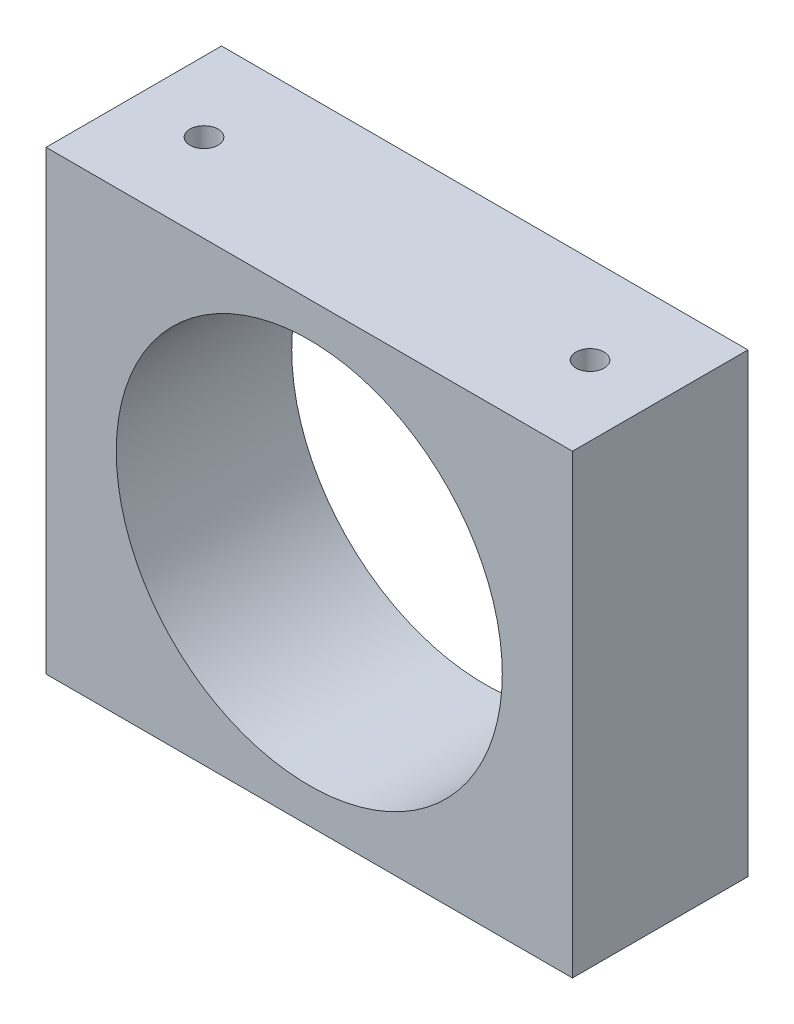
ISO-10303-21;
HEADER;
FILE_DESCRIPTION(('STEP AP214'),'2;1');
FILE_NAME('part.step','',(''),(''),'','','');
FILE_SCHEMA(('AUTOMOTIVE_DESIGN { 1 0 10303 214 1 1 1 1 }'));
ENDSEC;
DATA;
#1=APPLICATION_CONTEXT('core data for automotive mechanical design processes');
#2=APPLICATION_PROTOCOL_DEFINITION('international standard','automotive_design',2000,#1);
#3=PRODUCT_CONTEXT('',#1,'mechanical');
#4=PRODUCT('Part','Part','',(#3));
#5=PRODUCT_RELATED_PRODUCT_CATEGORY('part','',(#4));
#6=PRODUCT_DEFINITION_FORMATION('','',#4);
#7=PRODUCT_DEFINITION_CONTEXT('part definition',#1,'design');
#8=PRODUCT_DEFINITION('design','',#6,#7);
#9=PRODUCT_DEFINITION_SHAPE('','',#8);
#10=(LENGTH_UNIT() NAMED_UNIT(*) SI_UNIT(.MILLI.,.METRE.));
#11=(NAMED_UNIT(*) PLANE_ANGLE_UNIT() SI_UNIT($,.RADIAN.));
#12=(NAMED_UNIT(*) SI_UNIT($,.STERADIAN.) SOLID_ANGLE_UNIT());
#13=UNCERTAINTY_MEASURE_WITH_UNIT(LENGTH_MEASURE(1.E-05),#10,'distance_accuracy_value','');
#14=(GEOMETRIC_REPRESENTATION_CONTEXT(3) GLOBAL_UNCERTAINTY_ASSIGNED_CONTEXT((#13)) GLOBAL_UNIT_ASSIGNED_CONTEXT((#10,
#11,#12)) REPRESENTATION_CONTEXT('',''));
#15=CARTESIAN_POINT('',(0.,0.,0.));
#16=DIRECTION('',(0.,0.,1.));
#17=DIRECTION('',(1.,0.,0.));
#18=AXIS2_PLACEMENT_3D('',#15,#16,#17);
#19=CARTESIAN_POINT('',(0.,0.,10.));
#20=DIRECTION('',(0.,0.,-1.));
#21=DIRECTION('',(-1.,0.,0.));
#22=AXIS2_PLACEMENT_3D('',#19,#20,#21);
#23=PLANE('',#22);
#24=DIRECTION('',(0.,-1.,0.));
#25=VECTOR('',#24,1.);
#26=CARTESIAN_POINT('',(0.,0.,10.));
#27=LINE('',#26,#25);
#28=CARTESIAN_POINT('',(0.,26.,10.));
#29=VERTEX_POINT('',#28);
#30=CARTESIAN_POINT('',(0.,0.,10.));
#31=VERTEX_POINT('',#30);
#32=EDGE_CURVE('E134',#29,#31,#27,.T.);
#33=ORIENTED_EDGE('',*,*,#32,.T.);
#34=DIRECTION('',(1.,0.,0.));
#35=VECTOR('',#34,1.);
#36=CARTESIAN_POINT('',(0.,0.,10.));
#37=LINE('',#36,#35);
#38=CARTESIAN_POINT('',(30.,0.,10.));
#39=VERTEX_POINT('',#38);
#40=EDGE_CURVE('E81',#31,#39,#37,.T.);
#41=ORIENTED_EDGE('',*,*,#40,.T.);
#42=DIRECTION('',(0.,1.,0.));
#43=VECTOR('',#42,1.);
#44=CARTESIAN_POINT('',(30.,0.,10.));
#45=LINE('',#44,#43);
#46=CARTESIAN_POINT('',(30.,26.,10.));
#47=VERTEX_POINT('',#46);
#48=EDGE_CURVE('E137',#39,#47,#45,.T.);
#49=ORIENTED_EDGE('',*,*,#48,.T.);
#50=DIRECTION('',(-1.,0.,0.));
#51=VECTOR('',#50,1.);
#52=CARTESIAN_POINT('',(0.,26.,10.));
#53=LINE('',#52,#51);
#54=EDGE_CURVE('E50',#47,#29,#53,.T.);
#55=ORIENTED_EDGE('',*,*,#54,.T.);
#56=EDGE_LOOP('',(#33,#41,#49,#55));
#57=FACE_BOUND('',#56,.T.);
#58=CARTESIAN_POINT('',(15.,13.,10.));
#59=DIRECTION('',(0.,0.,1.));
#60=DIRECTION('',(1.,0.,0.));
#61=AXIS2_PLACEMENT_3D('',#58,#59,#60);
#62=CIRCLE('',#61,11.);
#63=CARTESIAN_POINT('',(26.,13.,10.));
#64=VERTEX_POINT('',#63);
#65=EDGE_CURVE('E128',#64,#64,#62,.T.);
#66=ORIENTED_EDGE('',*,*,#65,.F.);
#67=EDGE_LOOP('',(#66));
#68=FACE_BOUND('',#67,.T.);
#69=ADVANCED_FACE('F33',(#57,#68),#23,.F.);
#70=CARTESIAN_POINT('',(0.,0.,0.));
#71=DIRECTION('',(0.,0.,-1.));
#72=DIRECTION('',(-1.,0.,0.));
#73=AXIS2_PLACEMENT_3D('',#70,#71,#72);
#74=PLANE('',#73);
#75=DIRECTION('',(0.,-1.,0.));
#76=VECTOR('',#75,1.);
#77=CARTESIAN_POINT('',(0.,0.,0.));
#78=LINE('',#77,#76);
#79=CARTESIAN_POINT('',(0.,26.,0.));
#80=VERTEX_POINT('',#79);
#81=CARTESIAN_POINT('',(0.,0.,0.));
#82=VERTEX_POINT('',#81);
#83=EDGE_CURVE('E131',#80,#82,#78,.T.);
#84=ORIENTED_EDGE('',*,*,#83,.F.);
#85=DIRECTION('',(-1.,0.,0.));
#86=VECTOR('',#85,1.);
#87=CARTESIAN_POINT('',(0.,26.,0.));
#88=LINE('',#87,#86);
#89=CARTESIAN_POINT('',(30.,26.,0.));
#90=VERTEX_POINT('',#89);
#91=EDGE_CURVE('E74',#90,#80,#88,.T.);
#92=ORIENTED_EDGE('',*,*,#91,.F.);
#93=DIRECTION('',(0.,1.,0.));
#94=VECTOR('',#93,1.);
#95=CARTESIAN_POINT('',(30.,0.,0.));
#96=LINE('',#95,#94);
#97=CARTESIAN_POINT('',(30.,0.,0.));
#98=VERTEX_POINT('',#97);
#99=EDGE_CURVE('E68',#98,#90,#96,.T.);
#100=ORIENTED_EDGE('',*,*,#99,.F.);
#101=DIRECTION('',(1.,0.,0.));
#102=VECTOR('',#101,1.);
#103=CARTESIAN_POINT('',(0.,0.,0.));
#104=LINE('',#103,#102);
#105=EDGE_CURVE('E143',#82,#98,#104,.T.);
#106=ORIENTED_EDGE('',*,*,#105,.F.);
#107=EDGE_LOOP('',(#84,#92,#100,#106));
#108=FACE_BOUND('',#107,.T.);
#109=CARTESIAN_POINT('',(15.,13.,0.));
#110=DIRECTION('',(0.,0.,1.));
#111=DIRECTION('',(1.,0.,0.));
#112=AXIS2_PLACEMENT_3D('',#109,#110,#111);
#113=CIRCLE('',#112,11.);
#114=CARTESIAN_POINT('',(26.,13.,0.));
#115=VERTEX_POINT('',#114);
#116=EDGE_CURVE('E127',#115,#115,#113,.T.);
#117=ORIENTED_EDGE('',*,*,#116,.T.);
#118=EDGE_LOOP('',(#117));
#119=FACE_BOUND('',#118,.T.);
#120=ADVANCED_FACE('F153',(#108,#119),#74,.T.);
#121=CARTESIAN_POINT('',(0.,0.,10.));
#122=DIRECTION('',(1.,0.,0.));
#123=DIRECTION('',(0.,0.,-1.));
#124=AXIS2_PLACEMENT_3D('',#121,#122,#123);
#125=PLANE('',#124);
#126=ORIENTED_EDGE('',*,*,#83,.T.);
#127=DIRECTION('',(0.,0.,-1.));
#128=VECTOR('',#127,1.);
#129=CARTESIAN_POINT('',(0.,0.,10.));
#130=LINE('',#129,#128);
#131=EDGE_CURVE('E11',#31,#82,#130,.T.);
#132=ORIENTED_EDGE('',*,*,#131,.F.);
#133=ORIENTED_EDGE('',*,*,#32,.F.);
#134=DIRECTION('',(0.,0.,-1.));
#135=VECTOR('',#134,1.);
#136=CARTESIAN_POINT('',(0.,26.,10.));
#137=LINE('',#136,#135);
#138=EDGE_CURVE('E140',#29,#80,#137,.T.);
#139=ORIENTED_EDGE('',*,*,#138,.T.);
#140=EDGE_LOOP('',(#126,#132,#133,#139));
#141=FACE_BOUND('',#140,.T.);
#142=ADVANCED_FACE('F35',(#141),#125,.F.);
#143=CARTESIAN_POINT('',(0.,0.,10.));
#144=DIRECTION('',(0.,1.,0.));
#145=DIRECTION('',(0.,0.,1.));
#146=AXIS2_PLACEMENT_3D('',#143,#144,#145);
#147=PLANE('',#146);
#148=CARTESIAN_POINT('',(4.,0.,5.));
#149=DIRECTION('',(0.,-1.,0.));
#150=DIRECTION('',(0.,0.,-1.));
#151=AXIS2_PLACEMENT_3D('',#148,#149,#150);
#152=CIRCLE('',#151,0.79999999999999);
#153=CARTESIAN_POINT('',(4.,0.,4.20000000000001));
#154=VERTEX_POINT('',#153);
#155=EDGE_CURVE('E105',#154,#154,#152,.T.);
#156=ORIENTED_EDGE('',*,*,#155,.F.);
#157=EDGE_LOOP('',(#156));
#158=FACE_BOUND('',#157,.T.);
#159=CARTESIAN_POINT('',(26.,0.,5.));
#160=DIRECTION('',(0.,-1.,0.));
#161=DIRECTION('',(0.,0.,-1.));
#162=AXIS2_PLACEMENT_3D('',#159,#160,#161);
#163=CIRCLE('',#162,0.799999999999992);
#164=CARTESIAN_POINT('',(26.,0.,4.20000000000001));
#165=VERTEX_POINT('',#164);
#166=EDGE_CURVE('E104',#165,#165,#163,.T.);
#167=ORIENTED_EDGE('',*,*,#166,.F.);
#168=EDGE_LOOP('',(#167));
#169=FACE_BOUND('',#168,.T.);
#170=ORIENTED_EDGE('',*,*,#105,.T.);
#171=DIRECTION('',(0.,0.,-1.));
#172=VECTOR('',#171,1.);
#173=CARTESIAN_POINT('',(30.,0.,10.));
#174=LINE('',#173,#172);
#175=EDGE_CURVE('E42',#39,#98,#174,.T.);
#176=ORIENTED_EDGE('',*,*,#175,.F.);
#177=ORIENTED_EDGE('',*,*,#40,.F.);
#178=ORIENTED_EDGE('',*,*,#131,.T.);
#179=EDGE_LOOP('',(#170,#176,#177,#178));
#180=FACE_BOUND('',#179,.T.);
#181=ADVANCED_FACE('F170',(#158,#169,#180),#147,.F.);
#182=CARTESIAN_POINT('',(30.,0.,10.));
#183=DIRECTION('',(-1.,0.,0.));
#184=DIRECTION('',(0.,0.,1.));
#185=AXIS2_PLACEMENT_3D('',#182,#183,#184);
#186=PLANE('',#185);
#187=ORIENTED_EDGE('',*,*,#99,.T.);
#188=DIRECTION('',(0.,0.,-1.));
#189=VECTOR('',#188,1.);
#190=CARTESIAN_POINT('',(30.,26.,10.));
#191=LINE('',#190,#189);
#192=EDGE_CURVE('E148',#47,#90,#191,.T.);
#193=ORIENTED_EDGE('',*,*,#192,.F.);
#194=ORIENTED_EDGE('',*,*,#48,.F.);
#195=ORIENTED_EDGE('',*,*,#175,.T.);
#196=EDGE_LOOP('',(#187,#193,#194,#195));
#197=FACE_BOUND('',#196,.T.);
#198=ADVANCED_FACE('F150',(#197),#186,.F.);
#199=CARTESIAN_POINT('',(0.,26.,10.));
#200=DIRECTION('',(0.,-1.,0.));
#201=DIRECTION('',(0.,0.,-1.));
#202=AXIS2_PLACEMENT_3D('',#199,#200,#201);
#203=PLANE('',#202);
#204=CARTESIAN_POINT('',(4.,26.,5.));
#205=DIRECTION('',(0.,1.,0.));
#206=DIRECTION('',(0.,0.,1.));
#207=AXIS2_PLACEMENT_3D('',#204,#205,#206);
#208=CIRCLE('',#207,0.79999999999999);
#209=CARTESIAN_POINT('',(4.,26.,5.79999999999999));
#210=VERTEX_POINT('',#209);
#211=EDGE_CURVE('E115',#210,#210,#208,.T.);
#212=ORIENTED_EDGE('',*,*,#211,.F.);
#213=EDGE_LOOP('',(#212));
#214=FACE_BOUND('',#213,.T.);
#215=CARTESIAN_POINT('',(26.,26.,5.));
#216=DIRECTION('',(0.,1.,0.));
#217=DIRECTION('',(0.,0.,1.));
#218=AXIS2_PLACEMENT_3D('',#215,#216,#217);
#219=CIRCLE('',#218,0.799999999999992);
#220=CARTESIAN_POINT('',(26.,26.,5.79999999999999));
#221=VERTEX_POINT('',#220);
#222=EDGE_CURVE('E121',#221,#221,#219,.T.);
#223=ORIENTED_EDGE('',*,*,#222,.F.);
#224=EDGE_LOOP('',(#223));
#225=FACE_BOUND('',#224,.T.);
#226=ORIENTED_EDGE('',*,*,#91,.T.);
#227=ORIENTED_EDGE('',*,*,#138,.F.);
#228=ORIENTED_EDGE('',*,*,#54,.F.);
#229=ORIENTED_EDGE('',*,*,#192,.T.);
#230=EDGE_LOOP('',(#226,#227,#228,#229));
#231=FACE_BOUND('',#230,.T.);
#232=ADVANCED_FACE('F158',(#214,#225,#231),#203,.F.);
#233=CARTESIAN_POINT('',(15.,13.,10.));
#234=DIRECTION('',(0.,0.,-1.));
#235=DIRECTION('',(-1.,0.,0.));
#236=AXIS2_PLACEMENT_3D('',#233,#234,#235);
#237=CYLINDRICAL_SURFACE('',#236,11.);
#238=ORIENTED_EDGE('',*,*,#65,.T.);
#239=EDGE_LOOP('',(#238));
#240=FACE_BOUND('',#239,.T.);
#241=ORIENTED_EDGE('',*,*,#116,.F.);
#242=EDGE_LOOP('',(#241));
#243=FACE_BOUND('',#242,.T.);
#244=ADVANCED_FACE('F160',(#240,#243),#237,.F.);
#245=CARTESIAN_POINT('',(26.,21.,5.));
#246=DIRECTION('',(0.,1.,0.));
#247=DIRECTION('',(0.,0.,1.));
#248=AXIS2_PLACEMENT_3D('',#245,#246,#247);
#249=CONICAL_SURFACE('',#248,0.799999999999988,1.02974425867665);
#250=CARTESIAN_POINT('',(26.,20.519311504778,5.));
#251=VERTEX_POINT('',#250);
#252=VERTEX_LOOP('',#251);
#253=FACE_BOUND('',#252,.T.);
#254=CARTESIAN_POINT('',(26.,21.,5.));
#255=DIRECTION('',(0.,1.,0.));
#256=DIRECTION('',(0.,0.,1.));
#257=AXIS2_PLACEMENT_3D('',#254,#255,#256);
#258=CIRCLE('',#257,0.799999999999988);
#259=CARTESIAN_POINT('',(26.,21.,5.79999999999999));
#260=VERTEX_POINT('',#259);
#261=EDGE_CURVE('E124',#260,#260,#258,.T.);
#262=ORIENTED_EDGE('',*,*,#261,.T.);
#263=EDGE_LOOP('',(#262));
#264=FACE_BOUND('',#263,.T.);
#265=ADVANCED_FACE('F167',(#253,#264),#249,.F.);
#266=CARTESIAN_POINT('',(26.,26.,5.));
#267=DIRECTION('',(0.,1.,0.));
#268=DIRECTION('',(0.,0.,1.));
#269=AXIS2_PLACEMENT_3D('',#266,#267,#268);
#270=CYLINDRICAL_SURFACE('',#269,0.79999999999999);
#271=ORIENTED_EDGE('',*,*,#261,.F.);
#272=EDGE_LOOP('',(#271));
#273=FACE_BOUND('',#272,.T.);
#274=ORIENTED_EDGE('',*,*,#222,.T.);
#275=EDGE_LOOP('',(#274));
#276=FACE_BOUND('',#275,.T.);
#277=ADVANCED_FACE('F184',(#273,#276),#270,.F.);
#278=CARTESIAN_POINT('',(4.,21.,5.));
#279=DIRECTION('',(0.,1.,0.));
#280=DIRECTION('',(0.,0.,1.));
#281=AXIS2_PLACEMENT_3D('',#278,#279,#280);
#282=CONICAL_SURFACE('',#281,0.799999999999988,1.02974425867665);
#283=CARTESIAN_POINT('',(4.,20.519311504778,5.));
#284=VERTEX_POINT('',#283);
#285=VERTEX_LOOP('',#284);
#286=FACE_BOUND('',#285,.T.);
#287=CARTESIAN_POINT('',(4.,21.,5.));
#288=DIRECTION('',(0.,1.,0.));
#289=DIRECTION('',(0.,0.,1.));
#290=AXIS2_PLACEMENT_3D('',#287,#288,#289);
#291=CIRCLE('',#290,0.799999999999988);
#292=CARTESIAN_POINT('',(4.,21.,5.79999999999999));
#293=VERTEX_POINT('',#292);
#294=EDGE_CURVE('E118',#293,#293,#291,.T.);
#295=ORIENTED_EDGE('',*,*,#294,.T.);
#296=EDGE_LOOP('',(#295));
#297=FACE_BOUND('',#296,.T.);
#298=ADVANCED_FACE('F188',(#286,#297),#282,.F.);
#299=CARTESIAN_POINT('',(4.,26.,5.));
#300=DIRECTION('',(0.,1.,0.));
#301=DIRECTION('',(0.,0.,1.));
#302=AXIS2_PLACEMENT_3D('',#299,#300,#301);
#303=CYLINDRICAL_SURFACE('',#302,0.799999999999989);
#304=ORIENTED_EDGE('',*,*,#294,.F.);
#305=EDGE_LOOP('',(#304));
#306=FACE_BOUND('',#305,.T.);
#307=ORIENTED_EDGE('',*,*,#211,.T.);
#308=EDGE_LOOP('',(#307));
#309=FACE_BOUND('',#308,.T.);
#310=ADVANCED_FACE('F192',(#306,#309),#303,.F.);
#311=CARTESIAN_POINT('',(26.,5.,5.));
#312=DIRECTION('',(0.,-1.,0.));
#313=DIRECTION('',(0.,0.,-1.));
#314=AXIS2_PLACEMENT_3D('',#311,#312,#313);
#315=CONICAL_SURFACE('',#314,0.799999999999988,1.02974425867665);
#316=CARTESIAN_POINT('',(26.,5.48068849522205,5.));
#317=VERTEX_POINT('',#316);
#318=VERTEX_LOOP('',#317);
#319=FACE_BOUND('',#318,.T.);
#320=CARTESIAN_POINT('',(26.,5.,5.));
#321=DIRECTION('',(0.,-1.,0.));
#322=DIRECTION('',(0.,0.,-1.));
#323=AXIS2_PLACEMENT_3D('',#320,#321,#322);
#324=CIRCLE('',#323,0.799999999999988);
#325=CARTESIAN_POINT('',(26.,5.,4.20000000000001));
#326=VERTEX_POINT('',#325);
#327=EDGE_CURVE('E108',#326,#326,#324,.T.);
#328=ORIENTED_EDGE('',*,*,#327,.T.);
#329=EDGE_LOOP('',(#328));
#330=FACE_BOUND('',#329,.T.);
#331=ADVANCED_FACE('F196',(#319,#330),#315,.F.);
#332=CARTESIAN_POINT('',(26.,0.,5.));
#333=DIRECTION('',(0.,-1.,0.));
#334=DIRECTION('',(0.,0.,-1.));
#335=AXIS2_PLACEMENT_3D('',#332,#333,#334);
#336=CYLINDRICAL_SURFACE('',#335,0.79999999999999);
#337=ORIENTED_EDGE('',*,*,#327,.F.);
#338=EDGE_LOOP('',(#337));
#339=FACE_BOUND('',#338,.T.);
#340=ORIENTED_EDGE('',*,*,#166,.T.);
#341=EDGE_LOOP('',(#340));
#342=FACE_BOUND('',#341,.T.);
#343=ADVANCED_FACE('F98',(#339,#342),#336,.F.);
#344=CARTESIAN_POINT('',(4.,5.,5.));
#345=DIRECTION('',(0.,-1.,0.));
#346=DIRECTION('',(0.,0.,-1.));
#347=AXIS2_PLACEMENT_3D('',#344,#345,#346);
#348=CONICAL_SURFACE('',#347,0.799999999999988,1.02974425867665);
#349=CARTESIAN_POINT('',(4.,5.48068849522205,5.));
#350=VERTEX_POINT('',#349);
#351=VERTEX_LOOP('',#350);
#352=FACE_BOUND('',#351,.T.);
#353=CARTESIAN_POINT('',(4.,5.,5.));
#354=DIRECTION('',(0.,-1.,0.));
#355=DIRECTION('',(0.,0.,-1.));
#356=AXIS2_PLACEMENT_3D('',#353,#354,#355);
#357=CIRCLE('',#356,0.799999999999988);
#358=CARTESIAN_POINT('',(4.,5.,4.20000000000001));
#359=VERTEX_POINT('',#358);
#360=EDGE_CURVE('E102',#359,#359,#357,.T.);
#361=ORIENTED_EDGE('',*,*,#360,.T.);
#362=EDGE_LOOP('',(#361));
#363=FACE_BOUND('',#362,.T.);
#364=ADVANCED_FACE('F94',(#352,#363),#348,.F.);
#365=CARTESIAN_POINT('',(4.,0.,5.));
#366=DIRECTION('',(0.,-1.,0.));
#367=DIRECTION('',(0.,0.,-1.));
#368=AXIS2_PLACEMENT_3D('',#365,#366,#367);
#369=CYLINDRICAL_SURFACE('',#368,0.799999999999989);
#370=ORIENTED_EDGE('',*,*,#360,.F.);
#371=EDGE_LOOP('',(#370));
#372=FACE_BOUND('',#371,.T.);
#373=ORIENTED_EDGE('',*,*,#155,.T.);
#374=EDGE_LOOP('',(#373));
#375=FACE_BOUND('',#374,.T.);
#376=ADVANCED_FACE('F97',(#372,#375),#369,.F.);
#377=CLOSED_SHELL('',(#69,#120,#142,#181,#198,#232,#244,#265,#277,#298,#310,#331,#343,#364,#376));
#378=MANIFOLD_SOLID_BREP('B2',#377);
#379=ADVANCED_BREP_SHAPE_REPRESENTATION('',(#18,#378),#14);
#380=SHAPE_DEFINITION_REPRESENTATION(#9,#379);
ENDSEC;
END-ISO-10303-21;
